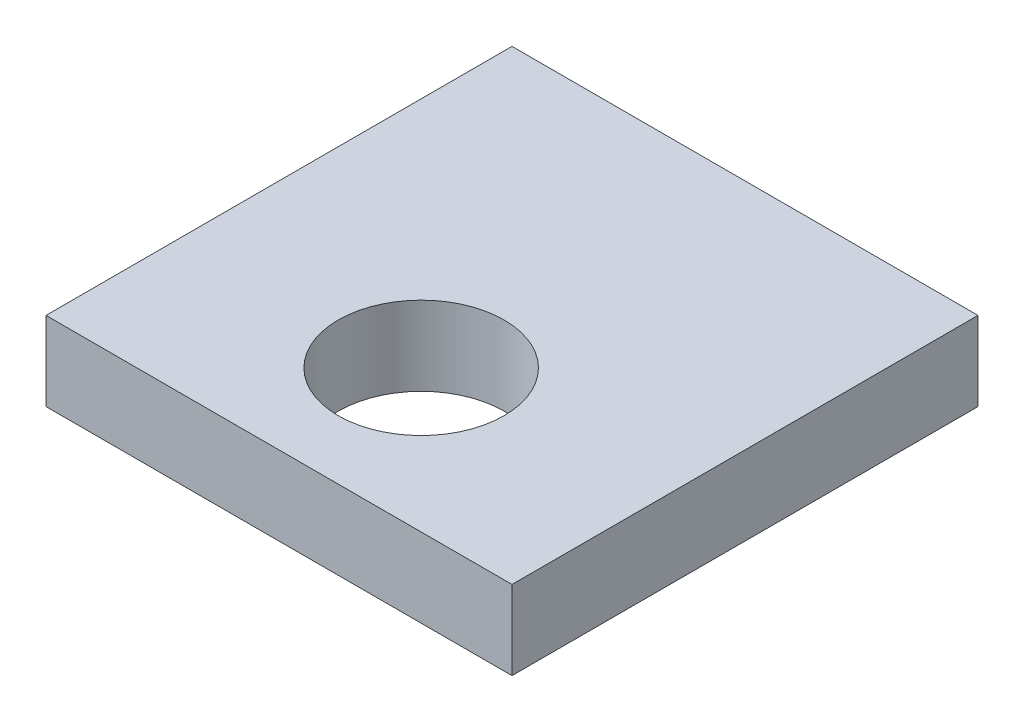
ISO-10303-21;
HEADER;
FILE_DESCRIPTION(('STEP AP214'),'2;1');
FILE_NAME('part.step','',(''),(''),'','','');
FILE_SCHEMA(('AUTOMOTIVE_DESIGN { 1 0 10303 214 1 1 1 1 }'));
ENDSEC;
DATA;
#1=APPLICATION_CONTEXT('core data for automotive mechanical design processes');
#2=APPLICATION_PROTOCOL_DEFINITION('international standard','automotive_design',2000,#1);
#3=PRODUCT_CONTEXT('',#1,'mechanical');
#4=PRODUCT('Part','Part','',(#3));
#5=PRODUCT_RELATED_PRODUCT_CATEGORY('part','',(#4));
#6=PRODUCT_DEFINITION_FORMATION('','',#4);
#7=PRODUCT_DEFINITION_CONTEXT('part definition',#1,'design');
#8=PRODUCT_DEFINITION('design','',#6,#7);
#9=PRODUCT_DEFINITION_SHAPE('','',#8);
#10=(LENGTH_UNIT() NAMED_UNIT(*) SI_UNIT(.MILLI.,.METRE.));
#11=(NAMED_UNIT(*) PLANE_ANGLE_UNIT() SI_UNIT($,.RADIAN.));
#12=(NAMED_UNIT(*) SI_UNIT($,.STERADIAN.) SOLID_ANGLE_UNIT());
#13=UNCERTAINTY_MEASURE_WITH_UNIT(LENGTH_MEASURE(1.E-05),#10,'distance_accuracy_value','');
#14=(GEOMETRIC_REPRESENTATION_CONTEXT(3) GLOBAL_UNCERTAINTY_ASSIGNED_CONTEXT((#13)) GLOBAL_UNIT_ASSIGNED_CONTEXT((#10,
#11,#12)) REPRESENTATION_CONTEXT('',''));
#15=CARTESIAN_POINT('',(0.,0.,0.));
#16=DIRECTION('',(0.,0.,1.));
#17=DIRECTION('',(1.,0.,0.));
#18=AXIS2_PLACEMENT_3D('',#15,#16,#17);
#19=CARTESIAN_POINT('',(0.,10.,0.));
#20=DIRECTION('',(0.,1.,0.));
#21=DIRECTION('',(0.,0.,1.));
#22=AXIS2_PLACEMENT_3D('',#19,#20,#21);
#23=PLANE('',#22);
#24=DIRECTION('',(0.,0.,1.));
#25=VECTOR('',#24,1.);
#26=CARTESIAN_POINT('',(-41.2737252886669,10.,-22.2345552361528));
#27=LINE('',#26,#25);
#28=CARTESIAN_POINT('',(-41.2737252886669,10.,-22.2345552361528));
#29=VERTEX_POINT('',#28);
#30=CARTESIAN_POINT('',(-41.2737252886669,10.,36.7654447638472));
#31=VERTEX_POINT('',#30);
#32=EDGE_CURVE('E86',#29,#31,#27,.T.);
#33=ORIENTED_EDGE('',*,*,#32,.T.);
#34=DIRECTION('',(1.,0.,0.));
#35=VECTOR('',#34,1.);
#36=CARTESIAN_POINT('',(-41.2737252886669,10.,36.7654447638472));
#37=LINE('',#36,#35);
#38=CARTESIAN_POINT('',(17.7262747113331,10.,36.7654447638472));
#39=VERTEX_POINT('',#38);
#40=EDGE_CURVE('E81',#31,#39,#37,.T.);
#41=ORIENTED_EDGE('',*,*,#40,.T.);
#42=DIRECTION('',(0.,0.,-1.));
#43=VECTOR('',#42,1.);
#44=CARTESIAN_POINT('',(17.7262747113331,10.,-22.2345552361528));
#45=LINE('',#44,#43);
#46=CARTESIAN_POINT('',(17.7262747113331,10.,-22.2345552361528));
#47=VERTEX_POINT('',#46);
#48=EDGE_CURVE('E84',#39,#47,#45,.T.);
#49=ORIENTED_EDGE('',*,*,#48,.T.);
#50=DIRECTION('',(-1.,0.,0.));
#51=VECTOR('',#50,1.);
#52=CARTESIAN_POINT('',(-41.2737252886669,10.,-22.2345552361528));
#53=LINE('',#52,#51);
#54=EDGE_CURVE('E51',#47,#29,#53,.T.);
#55=ORIENTED_EDGE('',*,*,#54,.T.);
#56=EDGE_LOOP('',(#33,#41,#49,#55));
#57=FACE_BOUND('',#56,.T.);
#58=CARTESIAN_POINT('',(-11.7737252886669,10.,18.7654447638472));
#59=DIRECTION('',(0.,1.,0.));
#60=DIRECTION('',(0.,0.,1.));
#61=AXIS2_PLACEMENT_3D('',#58,#59,#60);
#62=CIRCLE('',#61,10.5);
#63=CARTESIAN_POINT('',(-11.7737252886669,10.,29.2654447638472));
#64=VERTEX_POINT('',#63);
#65=EDGE_CURVE('E101',#64,#64,#62,.T.);
#66=ORIENTED_EDGE('',*,*,#65,.F.);
#67=EDGE_LOOP('',(#66));
#68=FACE_BOUND('',#67,.T.);
#69=ADVANCED_FACE('F34',(#57,#68),#23,.T.);
#70=CARTESIAN_POINT('',(0.,0.,0.));
#71=DIRECTION('',(0.,1.,0.));
#72=DIRECTION('',(0.,0.,1.));
#73=AXIS2_PLACEMENT_3D('',#70,#71,#72);
#74=PLANE('',#73);
#75=DIRECTION('',(0.,0.,1.));
#76=VECTOR('',#75,1.);
#77=CARTESIAN_POINT('',(-41.2737252886669,0.,-22.2345552361528));
#78=LINE('',#77,#76);
#79=CARTESIAN_POINT('',(-41.2737252886669,0.,-22.2345552361528));
#80=VERTEX_POINT('',#79);
#81=CARTESIAN_POINT('',(-41.2737252886669,0.,36.7654447638472));
#82=VERTEX_POINT('',#81);
#83=EDGE_CURVE('E98',#80,#82,#78,.T.);
#84=ORIENTED_EDGE('',*,*,#83,.F.);
#85=DIRECTION('',(-1.,0.,0.));
#86=VECTOR('',#85,1.);
#87=CARTESIAN_POINT('',(-41.2737252886669,0.,-22.2345552361528));
#88=LINE('',#87,#86);
#89=CARTESIAN_POINT('',(17.7262747113331,0.,-22.2345552361528));
#90=VERTEX_POINT('',#89);
#91=EDGE_CURVE('E74',#90,#80,#88,.T.);
#92=ORIENTED_EDGE('',*,*,#91,.F.);
#93=DIRECTION('',(0.,0.,-1.));
#94=VECTOR('',#93,1.);
#95=CARTESIAN_POINT('',(17.7262747113331,0.,-22.2345552361528));
#96=LINE('',#95,#94);
#97=CARTESIAN_POINT('',(17.7262747113331,0.,36.7654447638472));
#98=VERTEX_POINT('',#97);
#99=EDGE_CURVE('E68',#98,#90,#96,.T.);
#100=ORIENTED_EDGE('',*,*,#99,.F.);
#101=DIRECTION('',(1.,0.,0.));
#102=VECTOR('',#101,1.);
#103=CARTESIAN_POINT('',(-41.2737252886669,0.,36.7654447638472));
#104=LINE('',#103,#102);
#105=EDGE_CURVE('E90',#82,#98,#104,.T.);
#106=ORIENTED_EDGE('',*,*,#105,.F.);
#107=EDGE_LOOP('',(#84,#92,#100,#106));
#108=FACE_BOUND('',#107,.T.);
#109=CARTESIAN_POINT('',(-11.7737252886669,0.,18.7654447638472));
#110=DIRECTION('',(0.,1.,0.));
#111=DIRECTION('',(0.,0.,1.));
#112=AXIS2_PLACEMENT_3D('',#109,#110,#111);
#113=CIRCLE('',#112,10.5);
#114=CARTESIAN_POINT('',(-11.7737252886669,0.,29.2654447638472));
#115=VERTEX_POINT('',#114);
#116=EDGE_CURVE('E113',#115,#115,#113,.T.);
#117=ORIENTED_EDGE('',*,*,#116,.T.);
#118=EDGE_LOOP('',(#117));
#119=FACE_BOUND('',#118,.T.);
#120=ADVANCED_FACE('F109',(#108,#119),#74,.F.);
#121=CARTESIAN_POINT('',(-41.2737252886669,10.,-22.2345552361528));
#122=DIRECTION('',(1.,0.,0.));
#123=DIRECTION('',(0.,0.,-1.));
#124=AXIS2_PLACEMENT_3D('',#121,#122,#123);
#125=PLANE('',#124);
#126=ORIENTED_EDGE('',*,*,#83,.T.);
#127=DIRECTION('',(0.,-1.,0.));
#128=VECTOR('',#127,1.);
#129=CARTESIAN_POINT('',(-41.2737252886669,10.,36.7654447638472));
#130=LINE('',#129,#128);
#131=EDGE_CURVE('E11',#31,#82,#130,.T.);
#132=ORIENTED_EDGE('',*,*,#131,.F.);
#133=ORIENTED_EDGE('',*,*,#32,.F.);
#134=DIRECTION('',(0.,-1.,0.));
#135=VECTOR('',#134,1.);
#136=CARTESIAN_POINT('',(-41.2737252886669,10.,-22.2345552361528));
#137=LINE('',#136,#135);
#138=EDGE_CURVE('E94',#29,#80,#137,.T.);
#139=ORIENTED_EDGE('',*,*,#138,.T.);
#140=EDGE_LOOP('',(#126,#132,#133,#139));
#141=FACE_BOUND('',#140,.T.);
#142=ADVANCED_FACE('F36',(#141),#125,.F.);
#143=CARTESIAN_POINT('',(-41.2737252886669,10.,36.7654447638472));
#144=DIRECTION('',(0.,0.,-1.));
#145=DIRECTION('',(-1.,0.,0.));
#146=AXIS2_PLACEMENT_3D('',#143,#144,#145);
#147=PLANE('',#146);
#148=ORIENTED_EDGE('',*,*,#105,.T.);
#149=DIRECTION('',(0.,-1.,0.));
#150=VECTOR('',#149,1.);
#151=CARTESIAN_POINT('',(17.7262747113331,10.,36.7654447638472));
#152=LINE('',#151,#150);
#153=EDGE_CURVE('E43',#39,#98,#152,.T.);
#154=ORIENTED_EDGE('',*,*,#153,.F.);
#155=ORIENTED_EDGE('',*,*,#40,.F.);
#156=ORIENTED_EDGE('',*,*,#131,.T.);
#157=EDGE_LOOP('',(#148,#154,#155,#156));
#158=FACE_BOUND('',#157,.T.);
#159=ADVANCED_FACE('F89',(#158),#147,.F.);
#160=CARTESIAN_POINT('',(17.7262747113331,10.,-22.2345552361528));
#161=DIRECTION('',(-1.,0.,0.));
#162=DIRECTION('',(0.,0.,1.));
#163=AXIS2_PLACEMENT_3D('',#160,#161,#162);
#164=PLANE('',#163);
#165=ORIENTED_EDGE('',*,*,#99,.T.);
#166=DIRECTION('',(0.,-1.,0.));
#167=VECTOR('',#166,1.);
#168=CARTESIAN_POINT('',(17.7262747113331,10.,-22.2345552361528));
#169=LINE('',#168,#167);
#170=EDGE_CURVE('E91',#47,#90,#169,.T.);
#171=ORIENTED_EDGE('',*,*,#170,.F.);
#172=ORIENTED_EDGE('',*,*,#48,.F.);
#173=ORIENTED_EDGE('',*,*,#153,.T.);
#174=EDGE_LOOP('',(#165,#171,#172,#173));
#175=FACE_BOUND('',#174,.T.);
#176=ADVANCED_FACE('F92',(#175),#164,.F.);
#177=CARTESIAN_POINT('',(-41.2737252886669,10.,-22.2345552361528));
#178=DIRECTION('',(0.,0.,1.));
#179=DIRECTION('',(1.,0.,0.));
#180=AXIS2_PLACEMENT_3D('',#177,#178,#179);
#181=PLANE('',#180);
#182=ORIENTED_EDGE('',*,*,#91,.T.);
#183=ORIENTED_EDGE('',*,*,#138,.F.);
#184=ORIENTED_EDGE('',*,*,#54,.F.);
#185=ORIENTED_EDGE('',*,*,#170,.T.);
#186=EDGE_LOOP('',(#182,#183,#184,#185));
#187=FACE_BOUND('',#186,.T.);
#188=ADVANCED_FACE('F106',(#187),#181,.F.);
#189=CARTESIAN_POINT('',(-11.7737252886669,10.,18.7654447638472));
#190=DIRECTION('',(0.,-1.,0.));
#191=DIRECTION('',(0.,0.,-1.));
#192=AXIS2_PLACEMENT_3D('',#189,#190,#191);
#193=CYLINDRICAL_SURFACE('',#192,10.5);
#194=ORIENTED_EDGE('',*,*,#65,.T.);
#195=EDGE_LOOP('',(#194));
#196=FACE_BOUND('',#195,.T.);
#197=ORIENTED_EDGE('',*,*,#116,.F.);
#198=EDGE_LOOP('',(#197));
#199=FACE_BOUND('',#198,.T.);
#200=ADVANCED_FACE('F119',(#196,#199),#193,.F.);
#201=CLOSED_SHELL('',(#69,#120,#142,#159,#176,#188,#200));
#202=MANIFOLD_SOLID_BREP('B2',#201);
#203=ADVANCED_BREP_SHAPE_REPRESENTATION('',(#18,#202),#14);
#204=SHAPE_DEFINITION_REPRESENTATION(#9,#203);
ENDSEC;
END-ISO-10303-21;
